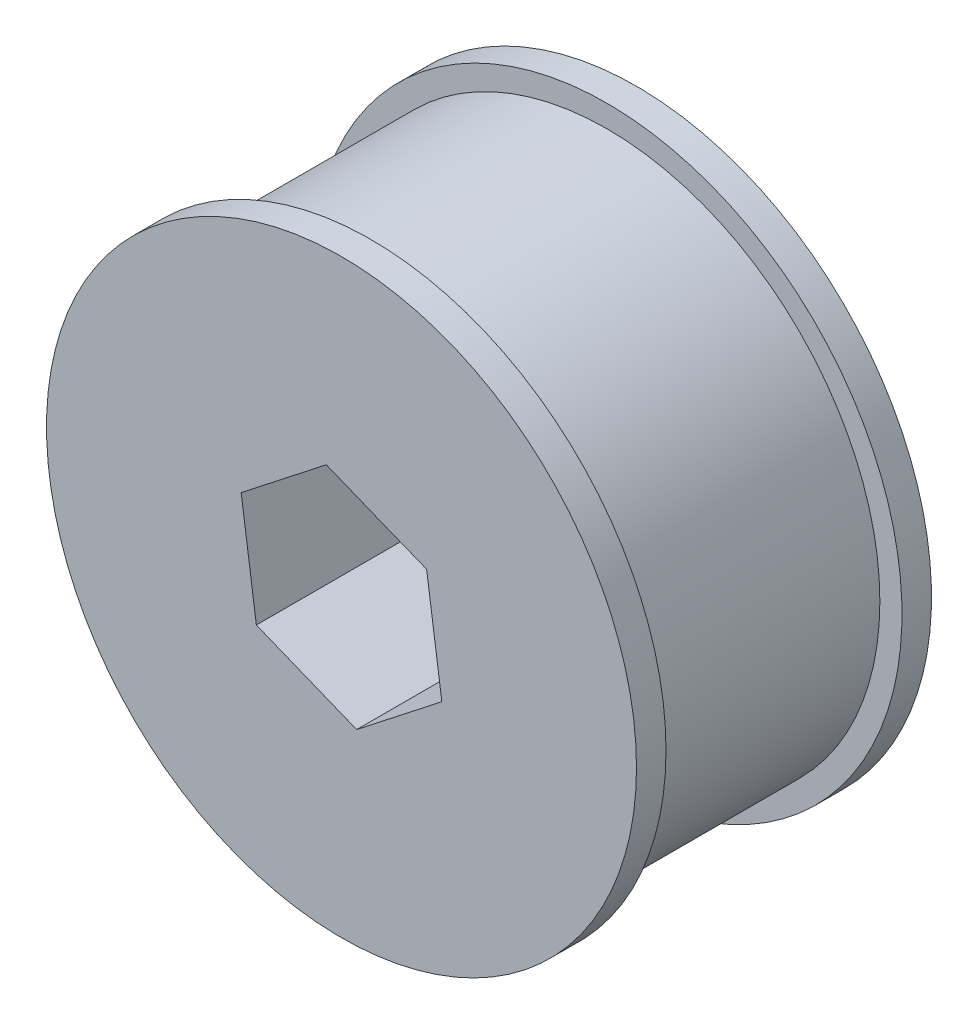
ISO-10303-21;
HEADER;
FILE_DESCRIPTION(('STEP AP214'),'2;1');
FILE_NAME('part.step','',(''),(''),'','','');
FILE_SCHEMA(('AUTOMOTIVE_DESIGN { 1 0 10303 214 1 1 1 1 }'));
ENDSEC;
DATA;
#1=APPLICATION_CONTEXT('core data for automotive mechanical design processes');
#2=APPLICATION_PROTOCOL_DEFINITION('international standard','automotive_design',2000,#1);
#3=PRODUCT_CONTEXT('',#1,'mechanical');
#4=PRODUCT('Part','Part','',(#3));
#5=PRODUCT_RELATED_PRODUCT_CATEGORY('part','',(#4));
#6=PRODUCT_DEFINITION_FORMATION('','',#4);
#7=PRODUCT_DEFINITION_CONTEXT('part definition',#1,'design');
#8=PRODUCT_DEFINITION('design','',#6,#7);
#9=PRODUCT_DEFINITION_SHAPE('','',#8);
#10=(LENGTH_UNIT() NAMED_UNIT(*) SI_UNIT(.MILLI.,.METRE.));
#11=(NAMED_UNIT(*) PLANE_ANGLE_UNIT() SI_UNIT($,.RADIAN.));
#12=(NAMED_UNIT(*) SI_UNIT($,.STERADIAN.) SOLID_ANGLE_UNIT());
#13=UNCERTAINTY_MEASURE_WITH_UNIT(LENGTH_MEASURE(1.E-05),#10,'distance_accuracy_value','');
#14=(GEOMETRIC_REPRESENTATION_CONTEXT(3) GLOBAL_UNCERTAINTY_ASSIGNED_CONTEXT((#13)) GLOBAL_UNIT_ASSIGNED_CONTEXT((#10,
#11,#12)) REPRESENTATION_CONTEXT('',''));
#15=CARTESIAN_POINT('',(0.,0.,0.));
#16=DIRECTION('',(0.,0.,1.));
#17=DIRECTION('',(1.,0.,0.));
#18=AXIS2_PLACEMENT_3D('',#15,#16,#17);
#19=CARTESIAN_POINT('',(0.,0.,20.));
#20=DIRECTION('',(0.,0.,-1.));
#21=DIRECTION('',(-1.,0.,0.));
#22=AXIS2_PLACEMENT_3D('',#19,#20,#21);
#23=CYLINDRICAL_SURFACE('',#22,18.5);
#24=CARTESIAN_POINT('',(0.,0.,18.));
#25=DIRECTION('',(0.,0.,1.));
#26=DIRECTION('',(1.,0.,0.));
#27=AXIS2_PLACEMENT_3D('',#24,#25,#26);
#28=CIRCLE('',#27,18.5);
#29=CARTESIAN_POINT('',(18.5,0.,18.));
#30=VERTEX_POINT('',#29);
#31=EDGE_CURVE('E46',#30,#30,#28,.T.);
#32=ORIENTED_EDGE('',*,*,#31,.F.);
#33=EDGE_LOOP('',(#32));
#34=FACE_BOUND('',#33,.T.);
#35=CARTESIAN_POINT('',(0.,0.,2.));
#36=DIRECTION('',(0.,0.,-1.));
#37=DIRECTION('',(-1.,0.,0.));
#38=AXIS2_PLACEMENT_3D('',#35,#36,#37);
#39=CIRCLE('',#38,18.5);
#40=CARTESIAN_POINT('',(-18.5,0.,2.));
#41=VERTEX_POINT('',#40);
#42=EDGE_CURVE('E11',#41,#41,#39,.T.);
#43=ORIENTED_EDGE('',*,*,#42,.F.);
#44=EDGE_LOOP('',(#43));
#45=FACE_BOUND('',#44,.T.);
#46=ADVANCED_FACE('F39',(#34,#45),#23,.T.);
#47=CARTESIAN_POINT('',(0.,0.,18.));
#48=DIRECTION('',(0.,0.,1.));
#49=DIRECTION('',(1.,0.,0.));
#50=AXIS2_PLACEMENT_3D('',#47,#48,#49);
#51=CYLINDRICAL_SURFACE('',#50,20.);
#52=CARTESIAN_POINT('',(0.,0.,18.));
#53=DIRECTION('',(0.,0.,1.));
#54=DIRECTION('',(1.,0.,0.));
#55=AXIS2_PLACEMENT_3D('',#52,#53,#54);
#56=CIRCLE('',#55,20.);
#57=CARTESIAN_POINT('',(20.,0.,18.));
#58=VERTEX_POINT('',#57);
#59=EDGE_CURVE('E147',#58,#58,#56,.T.);
#60=ORIENTED_EDGE('',*,*,#59,.T.);
#61=EDGE_LOOP('',(#60));
#62=FACE_BOUND('',#61,.T.);
#63=CARTESIAN_POINT('',(0.,0.,20.));
#64=DIRECTION('',(0.,0.,1.));
#65=DIRECTION('',(1.,0.,0.));
#66=AXIS2_PLACEMENT_3D('',#63,#64,#65);
#67=CIRCLE('',#66,20.);
#68=CARTESIAN_POINT('',(20.,0.,20.));
#69=VERTEX_POINT('',#68);
#70=EDGE_CURVE('E150',#69,#69,#67,.T.);
#71=ORIENTED_EDGE('',*,*,#70,.F.);
#72=EDGE_LOOP('',(#71));
#73=FACE_BOUND('',#72,.T.);
#74=ADVANCED_FACE('F165',(#62,#73),#51,.T.);
#75=CARTESIAN_POINT('',(0.,0.,18.));
#76=DIRECTION('',(0.,0.,1.));
#77=DIRECTION('',(1.,0.,0.));
#78=AXIS2_PLACEMENT_3D('',#75,#76,#77);
#79=PLANE('',#78);
#80=ORIENTED_EDGE('',*,*,#31,.T.);
#81=EDGE_LOOP('',(#80));
#82=FACE_BOUND('',#81,.T.);
#83=ORIENTED_EDGE('',*,*,#59,.F.);
#84=EDGE_LOOP('',(#83));
#85=FACE_BOUND('',#84,.T.);
#86=ADVANCED_FACE('F160',(#82,#85),#79,.F.);
#87=CARTESIAN_POINT('',(0.,0.,20.));
#88=DIRECTION('',(0.,0.,1.));
#89=DIRECTION('',(1.,0.,0.));
#90=AXIS2_PLACEMENT_3D('',#87,#88,#89);
#91=PLANE('',#90);
#92=DIRECTION('',(-0.140430519349393,0.990090535878038,0.));
#93=VECTOR('',#92,1.);
#94=CARTESIAN_POINT('',(6.80191765107049,-2.73811058969303,20.));
#95=LINE('',#94,#93);
#96=CARTESIAN_POINT('',(6.80191765107049,-2.73811058969303,20.));
#97=VERTEX_POINT('',#96);
#98=CARTESIAN_POINT('',(5.77223215458059,4.52157818543031,20.));
#99=VERTEX_POINT('',#98);
#100=EDGE_CURVE('E52',#97,#99,#95,.T.);
#101=ORIENTED_EDGE('',*,*,#100,.F.);
#102=DIRECTION('',(0.787228296442233,0.616661665162235,0.));
#103=VECTOR('',#102,1.);
#104=CARTESIAN_POINT('',(1.02968549648988,-7.25968877512334,20.));
#105=LINE('',#104,#103);
#106=CARTESIAN_POINT('',(1.02968549648988,-7.25968877512334,20.));
#107=VERTEX_POINT('',#106);
#108=EDGE_CURVE('E109',#107,#97,#105,.T.);
#109=ORIENTED_EDGE('',*,*,#108,.F.);
#110=DIRECTION('',(0.927658815791625,-0.373428870715802,0.));
#111=VECTOR('',#110,1.);
#112=CARTESIAN_POINT('',(-5.77223215458059,-4.52157818543033,20.));
#113=LINE('',#112,#111);
#114=CARTESIAN_POINT('',(-5.77223215458059,-4.52157818543033,20.));
#115=VERTEX_POINT('',#114);
#116=EDGE_CURVE('E114',#115,#107,#113,.T.);
#117=ORIENTED_EDGE('',*,*,#116,.F.);
#118=DIRECTION('',(0.140430519349393,-0.990090535878038,0.));
#119=VECTOR('',#118,1.);
#120=CARTESIAN_POINT('',(-6.80191765107049,2.73811058969302,20.));
#121=LINE('',#120,#119);
#122=CARTESIAN_POINT('',(-6.80191765107049,2.73811058969302,20.));
#123=VERTEX_POINT('',#122);
#124=EDGE_CURVE('E129',#123,#115,#121,.T.);
#125=ORIENTED_EDGE('',*,*,#124,.F.);
#126=DIRECTION('',(-0.787228296442232,-0.616661665162235,0.));
#127=VECTOR('',#126,1.);
#128=CARTESIAN_POINT('',(-1.0296854964899,7.25968877512333,20.));
#129=LINE('',#128,#127);
#130=CARTESIAN_POINT('',(-1.0296854964899,7.25968877512333,20.));
#131=VERTEX_POINT('',#130);
#132=EDGE_CURVE('E127',#131,#123,#129,.T.);
#133=ORIENTED_EDGE('',*,*,#132,.F.);
#134=DIRECTION('',(-0.927658815791625,0.373428870715802,0.));
#135=VECTOR('',#134,1.);
#136=CARTESIAN_POINT('',(5.77223215458059,4.52157818543031,20.));
#137=LINE('',#136,#135);
#138=EDGE_CURVE('E123',#99,#131,#137,.T.);
#139=ORIENTED_EDGE('',*,*,#138,.F.);
#140=EDGE_LOOP('',(#101,#109,#117,#125,#133,#139));
#141=FACE_BOUND('',#140,.T.);
#142=ORIENTED_EDGE('',*,*,#70,.T.);
#143=EDGE_LOOP('',(#142));
#144=FACE_BOUND('',#143,.T.);
#145=ADVANCED_FACE('F173',(#141,#144),#91,.T.);
#146=CARTESIAN_POINT('',(0.,0.,2.));
#147=DIRECTION('',(0.,0.,-1.));
#148=DIRECTION('',(-1.,0.,0.));
#149=AXIS2_PLACEMENT_3D('',#146,#147,#148);
#150=CYLINDRICAL_SURFACE('',#149,20.);
#151=CARTESIAN_POINT('',(0.,0.,2.));
#152=DIRECTION('',(0.,0.,-1.));
#153=DIRECTION('',(-1.,0.,0.));
#154=AXIS2_PLACEMENT_3D('',#151,#152,#153);
#155=CIRCLE('',#154,20.);
#156=CARTESIAN_POINT('',(-20.,0.,2.));
#157=VERTEX_POINT('',#156);
#158=EDGE_CURVE('E145',#157,#157,#155,.T.);
#159=ORIENTED_EDGE('',*,*,#158,.T.);
#160=EDGE_LOOP('',(#159));
#161=FACE_BOUND('',#160,.T.);
#162=CARTESIAN_POINT('',(0.,0.,0.));
#163=DIRECTION('',(0.,0.,-1.));
#164=DIRECTION('',(-1.,0.,0.));
#165=AXIS2_PLACEMENT_3D('',#162,#163,#164);
#166=CIRCLE('',#165,20.);
#167=CARTESIAN_POINT('',(-20.,0.,0.));
#168=VERTEX_POINT('',#167);
#169=EDGE_CURVE('E139',#168,#168,#166,.T.);
#170=ORIENTED_EDGE('',*,*,#169,.F.);
#171=EDGE_LOOP('',(#170));
#172=FACE_BOUND('',#171,.T.);
#173=ADVANCED_FACE('F169',(#161,#172),#150,.T.);
#174=CARTESIAN_POINT('',(0.,0.,2.));
#175=DIRECTION('',(0.,0.,-1.));
#176=DIRECTION('',(-1.,0.,0.));
#177=AXIS2_PLACEMENT_3D('',#174,#175,#176);
#178=PLANE('',#177);
#179=ORIENTED_EDGE('',*,*,#42,.T.);
#180=EDGE_LOOP('',(#179));
#181=FACE_BOUND('',#180,.T.);
#182=ORIENTED_EDGE('',*,*,#158,.F.);
#183=EDGE_LOOP('',(#182));
#184=FACE_BOUND('',#183,.T.);
#185=ADVANCED_FACE('F164',(#181,#184),#178,.F.);
#186=CARTESIAN_POINT('',(0.,0.,0.));
#187=DIRECTION('',(0.,0.,1.));
#188=DIRECTION('',(1.,0.,0.));
#189=AXIS2_PLACEMENT_3D('',#186,#187,#188);
#190=PLANE('',#189);
#191=DIRECTION('',(0.787228296442233,0.616661665162235,0.));
#192=VECTOR('',#191,1.);
#193=CARTESIAN_POINT('',(1.02968549648988,-7.25968877512334,0.));
#194=LINE('',#193,#192);
#195=CARTESIAN_POINT('',(1.02968549648988,-7.25968877512334,0.));
#196=VERTEX_POINT('',#195);
#197=CARTESIAN_POINT('',(6.80191765107049,-2.73811058969303,0.));
#198=VERTEX_POINT('',#197);
#199=EDGE_CURVE('E97',#196,#198,#194,.T.);
#200=ORIENTED_EDGE('',*,*,#199,.T.);
#201=DIRECTION('',(-0.140430519349393,0.990090535878038,0.));
#202=VECTOR('',#201,1.);
#203=CARTESIAN_POINT('',(6.80191765107049,-2.73811058969303,0.));
#204=LINE('',#203,#202);
#205=CARTESIAN_POINT('',(5.77223215458059,4.52157818543031,0.));
#206=VERTEX_POINT('',#205);
#207=EDGE_CURVE('E91',#198,#206,#204,.T.);
#208=ORIENTED_EDGE('',*,*,#207,.T.);
#209=DIRECTION('',(-0.927658815791625,0.373428870715802,0.));
#210=VECTOR('',#209,1.);
#211=CARTESIAN_POINT('',(5.77223215458059,4.52157818543031,0.));
#212=LINE('',#211,#210);
#213=CARTESIAN_POINT('',(-1.0296854964899,7.25968877512333,0.));
#214=VERTEX_POINT('',#213);
#215=EDGE_CURVE('E105',#206,#214,#212,.T.);
#216=ORIENTED_EDGE('',*,*,#215,.T.);
#217=DIRECTION('',(-0.787228296442232,-0.616661665162235,0.));
#218=VECTOR('',#217,1.);
#219=CARTESIAN_POINT('',(-1.0296854964899,7.25968877512333,0.));
#220=LINE('',#219,#218);
#221=CARTESIAN_POINT('',(-6.80191765107049,2.73811058969302,0.));
#222=VERTEX_POINT('',#221);
#223=EDGE_CURVE('E61',#214,#222,#220,.T.);
#224=ORIENTED_EDGE('',*,*,#223,.T.);
#225=DIRECTION('',(0.140430519349393,-0.990090535878038,0.));
#226=VECTOR('',#225,1.);
#227=CARTESIAN_POINT('',(-6.80191765107049,2.73811058969302,0.));
#228=LINE('',#227,#226);
#229=CARTESIAN_POINT('',(-5.77223215458059,-4.52157818543033,0.));
#230=VERTEX_POINT('',#229);
#231=EDGE_CURVE('E120',#222,#230,#228,.T.);
#232=ORIENTED_EDGE('',*,*,#231,.T.);
#233=DIRECTION('',(0.927658815791625,-0.373428870715802,0.));
#234=VECTOR('',#233,1.);
#235=CARTESIAN_POINT('',(-5.77223215458059,-4.52157818543033,0.));
#236=LINE('',#235,#234);
#237=EDGE_CURVE('E119',#230,#196,#236,.T.);
#238=ORIENTED_EDGE('',*,*,#237,.T.);
#239=EDGE_LOOP('',(#200,#208,#216,#224,#232,#238));
#240=FACE_BOUND('',#239,.T.);
#241=ORIENTED_EDGE('',*,*,#169,.T.);
#242=EDGE_LOOP('',(#241));
#243=FACE_BOUND('',#242,.T.);
#244=ADVANCED_FACE('F106',(#240,#243),#190,.F.);
#245=CARTESIAN_POINT('',(6.80191765107049,-2.73811058969303,0.));
#246=DIRECTION('',(0.990090535878038,0.140430519349393,0.));
#247=DIRECTION('',(-0.140430519349393,0.990090535878038,0.));
#248=AXIS2_PLACEMENT_3D('',#245,#246,#247);
#249=PLANE('',#248);
#250=ORIENTED_EDGE('',*,*,#100,.T.);
#251=DIRECTION('',(0.,0.,1.));
#252=VECTOR('',#251,1.);
#253=CARTESIAN_POINT('',(5.77223215458059,4.52157818543031,0.));
#254=LINE('',#253,#252);
#255=EDGE_CURVE('E90',#206,#99,#254,.T.);
#256=ORIENTED_EDGE('',*,*,#255,.F.);
#257=ORIENTED_EDGE('',*,*,#207,.F.);
#258=DIRECTION('',(0.,0.,1.));
#259=VECTOR('',#258,1.);
#260=CARTESIAN_POINT('',(6.80191765107049,-2.73811058969303,0.));
#261=LINE('',#260,#259);
#262=EDGE_CURVE('E133',#198,#97,#261,.T.);
#263=ORIENTED_EDGE('',*,*,#262,.T.);
#264=EDGE_LOOP('',(#250,#256,#257,#263));
#265=FACE_BOUND('',#264,.T.);
#266=ADVANCED_FACE('F93',(#265),#249,.F.);
#267=CARTESIAN_POINT('',(1.02968549648988,-7.25968877512334,0.));
#268=DIRECTION('',(0.616661665162235,-0.787228296442233,0.));
#269=DIRECTION('',(0.787228296442233,0.616661665162235,0.));
#270=AXIS2_PLACEMENT_3D('',#267,#268,#269);
#271=PLANE('',#270);
#272=ORIENTED_EDGE('',*,*,#108,.T.);
#273=ORIENTED_EDGE('',*,*,#262,.F.);
#274=ORIENTED_EDGE('',*,*,#199,.F.);
#275=DIRECTION('',(0.,0.,1.));
#276=VECTOR('',#275,1.);
#277=CARTESIAN_POINT('',(1.02968549648988,-7.25968877512334,0.));
#278=LINE('',#277,#276);
#279=EDGE_CURVE('E136',#196,#107,#278,.T.);
#280=ORIENTED_EDGE('',*,*,#279,.T.);
#281=EDGE_LOOP('',(#272,#273,#274,#280));
#282=FACE_BOUND('',#281,.T.);
#283=ADVANCED_FACE('F185',(#282),#271,.F.);
#284=CARTESIAN_POINT('',(-5.77223215458059,-4.52157818543033,0.));
#285=DIRECTION('',(-0.373428870715802,-0.927658815791625,0.));
#286=DIRECTION('',(0.927658815791625,-0.373428870715802,0.));
#287=AXIS2_PLACEMENT_3D('',#284,#285,#286);
#288=PLANE('',#287);
#289=ORIENTED_EDGE('',*,*,#116,.T.);
#290=ORIENTED_EDGE('',*,*,#279,.F.);
#291=ORIENTED_EDGE('',*,*,#237,.F.);
#292=DIRECTION('',(0.,0.,1.));
#293=VECTOR('',#292,1.);
#294=CARTESIAN_POINT('',(-5.77223215458059,-4.52157818543033,0.));
#295=LINE('',#294,#293);
#296=EDGE_CURVE('E138',#230,#115,#295,.T.);
#297=ORIENTED_EDGE('',*,*,#296,.T.);
#298=EDGE_LOOP('',(#289,#290,#291,#297));
#299=FACE_BOUND('',#298,.T.);
#300=ADVANCED_FACE('F199',(#299),#288,.F.);
#301=CARTESIAN_POINT('',(-6.80191765107049,2.73811058969302,0.));
#302=DIRECTION('',(-0.990090535878038,-0.140430519349393,0.));
#303=DIRECTION('',(0.140430519349393,-0.990090535878038,0.));
#304=AXIS2_PLACEMENT_3D('',#301,#302,#303);
#305=PLANE('',#304);
#306=ORIENTED_EDGE('',*,*,#124,.T.);
#307=ORIENTED_EDGE('',*,*,#296,.F.);
#308=ORIENTED_EDGE('',*,*,#231,.F.);
#309=DIRECTION('',(0.,0.,1.));
#310=VECTOR('',#309,1.);
#311=CARTESIAN_POINT('',(-6.80191765107049,2.73811058969302,0.));
#312=LINE('',#311,#310);
#313=EDGE_CURVE('E143',#222,#123,#312,.T.);
#314=ORIENTED_EDGE('',*,*,#313,.T.);
#315=EDGE_LOOP('',(#306,#307,#308,#314));
#316=FACE_BOUND('',#315,.T.);
#317=ADVANCED_FACE('F197',(#316),#305,.F.);
#318=CARTESIAN_POINT('',(-1.0296854964899,7.25968877512333,0.));
#319=DIRECTION('',(-0.616661665162235,0.787228296442232,0.));
#320=DIRECTION('',(-0.787228296442232,-0.616661665162235,0.));
#321=AXIS2_PLACEMENT_3D('',#318,#319,#320);
#322=PLANE('',#321);
#323=ORIENTED_EDGE('',*,*,#132,.T.);
#324=ORIENTED_EDGE('',*,*,#313,.F.);
#325=ORIENTED_EDGE('',*,*,#223,.F.);
#326=DIRECTION('',(0.,0.,1.));
#327=VECTOR('',#326,1.);
#328=CARTESIAN_POINT('',(-1.0296854964899,7.25968877512333,0.));
#329=LINE('',#328,#327);
#330=EDGE_CURVE('E98',#214,#131,#329,.T.);
#331=ORIENTED_EDGE('',*,*,#330,.T.);
#332=EDGE_LOOP('',(#323,#324,#325,#331));
#333=FACE_BOUND('',#332,.T.);
#334=ADVANCED_FACE('F193',(#333),#322,.F.);
#335=CARTESIAN_POINT('',(5.77223215458059,4.52157818543031,0.));
#336=DIRECTION('',(0.373428870715802,0.927658815791625,0.));
#337=DIRECTION('',(-0.927658815791625,0.373428870715802,0.));
#338=AXIS2_PLACEMENT_3D('',#335,#336,#337);
#339=PLANE('',#338);
#340=ORIENTED_EDGE('',*,*,#138,.T.);
#341=ORIENTED_EDGE('',*,*,#330,.F.);
#342=ORIENTED_EDGE('',*,*,#215,.F.);
#343=ORIENTED_EDGE('',*,*,#255,.T.);
#344=EDGE_LOOP('',(#340,#341,#342,#343));
#345=FACE_BOUND('',#344,.T.);
#346=ADVANCED_FACE('F103',(#345),#339,.F.);
#347=CLOSED_SHELL('',(#46,#74,#86,#145,#173,#185,#244,#266,#283,#300,#317,#334,#346));
#348=MANIFOLD_SOLID_BREP('B2',#347);
#349=ADVANCED_BREP_SHAPE_REPRESENTATION('',(#18,#348),#14);
#350=SHAPE_DEFINITION_REPRESENTATION(#9,#349);
ENDSEC;
END-ISO-10303-21;
